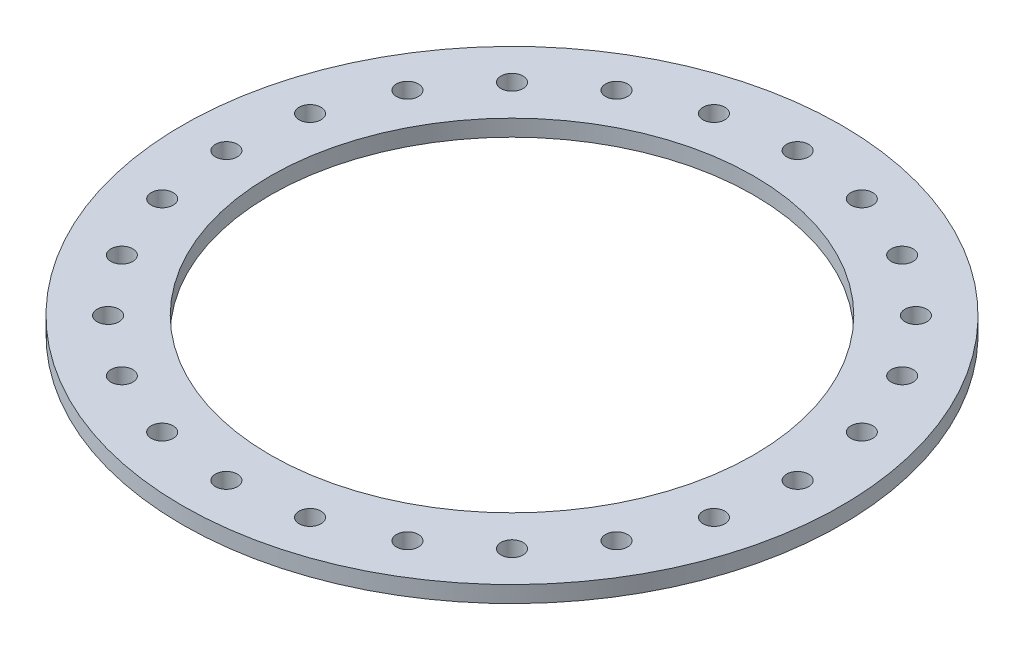
ISO-10303-21;
HEADER;
FILE_DESCRIPTION(('STEP AP214'),'2;1');
FILE_NAME('part.step','',(''),(''),'','','');
FILE_SCHEMA(('AUTOMOTIVE_DESIGN { 1 0 10303 214 1 1 1 1 }'));
ENDSEC;
DATA;
#1=APPLICATION_CONTEXT('core data for automotive mechanical design processes');
#2=APPLICATION_PROTOCOL_DEFINITION('international standard','automotive_design',2000,#1);
#3=PRODUCT_CONTEXT('',#1,'mechanical');
#4=PRODUCT('Part','Part','',(#3));
#5=PRODUCT_RELATED_PRODUCT_CATEGORY('part','',(#4));
#6=PRODUCT_DEFINITION_FORMATION('','',#4);
#7=PRODUCT_DEFINITION_CONTEXT('part definition',#1,'design');
#8=PRODUCT_DEFINITION('design','',#6,#7);
#9=PRODUCT_DEFINITION_SHAPE('','',#8);
#10=(LENGTH_UNIT() NAMED_UNIT(*) SI_UNIT(.MILLI.,.METRE.));
#11=(NAMED_UNIT(*) PLANE_ANGLE_UNIT() SI_UNIT($,.RADIAN.));
#12=(NAMED_UNIT(*) SI_UNIT($,.STERADIAN.) SOLID_ANGLE_UNIT());
#13=UNCERTAINTY_MEASURE_WITH_UNIT(LENGTH_MEASURE(1.E-05),#10,'distance_accuracy_value','');
#14=(GEOMETRIC_REPRESENTATION_CONTEXT(3) GLOBAL_UNCERTAINTY_ASSIGNED_CONTEXT((#13)) GLOBAL_UNIT_ASSIGNED_CONTEXT((#10,
#11,#12)) REPRESENTATION_CONTEXT('',''));
#15=CARTESIAN_POINT('',(0.,0.,0.));
#16=DIRECTION('',(0.,0.,1.));
#17=DIRECTION('',(1.,0.,0.));
#18=AXIS2_PLACEMENT_3D('',#15,#16,#17);
#19=CARTESIAN_POINT('',(0.,19.05,0.));
#20=DIRECTION('',(0.,1.,0.));
#21=DIRECTION('',(0.,0.,1.));
#22=AXIS2_PLACEMENT_3D('',#19,#20,#21);
#23=PLANE('',#22);
#24=CARTESIAN_POINT('',(85.4620486928481,19.05,-318.948707840651));
#25=DIRECTION('',(0.,1.,0.));
#26=DIRECTION('',(0.,0.,1.));
#27=AXIS2_PLACEMENT_3D('',#24,#25,#26);
#28=CIRCLE('',#27,12.7);
#29=CARTESIAN_POINT('',(85.4620486928481,19.05,-306.248707840651));
#30=VERTEX_POINT('',#29);
#31=EDGE_CURVE('E109',#30,#30,#28,.T.);
#32=ORIENTED_EDGE('',*,*,#31,.F.);
#33=EDGE_LOOP('',(#32));
#34=FACE_BOUND('',#33,.T.);
#35=CARTESIAN_POINT('',(165.099999999996,19.05,-285.961588329624));
#36=DIRECTION('',(0.,1.,0.));
#37=DIRECTION('',(0.,0.,1.));
#38=AXIS2_PLACEMENT_3D('',#35,#36,#37);
#39=CIRCLE('',#38,12.7);
#40=CARTESIAN_POINT('',(165.099999999996,19.05,-273.261588329624));
#41=VERTEX_POINT('',#40);
#42=EDGE_CURVE('E99',#41,#41,#39,.T.);
#43=ORIENTED_EDGE('',*,*,#42,.F.);
#44=EDGE_LOOP('',(#43));
#45=FACE_BOUND('',#44,.T.);
#46=CARTESIAN_POINT('',(233.486659147795,19.05,-233.486659147801));
#47=DIRECTION('',(0.,1.,0.));
#48=DIRECTION('',(0.,0.,1.));
#49=AXIS2_PLACEMENT_3D('',#46,#47,#48);
#50=CIRCLE('',#49,12.7);
#51=CARTESIAN_POINT('',(233.486659147795,19.05,-220.786659147801));
#52=VERTEX_POINT('',#51);
#53=EDGE_CURVE('E96',#52,#52,#50,.T.);
#54=ORIENTED_EDGE('',*,*,#53,.F.);
#55=EDGE_LOOP('',(#54));
#56=FACE_BOUND('',#55,.T.);
#57=CARTESIAN_POINT('',(285.96158832962,19.05,-165.100000000003));
#58=DIRECTION('',(0.,1.,0.));
#59=DIRECTION('',(0.,0.,1.));
#60=AXIS2_PLACEMENT_3D('',#57,#58,#59);
#61=CIRCLE('',#60,12.7);
#62=CARTESIAN_POINT('',(285.96158832962,19.05,-152.400000000003));
#63=VERTEX_POINT('',#62);
#64=EDGE_CURVE('E95',#63,#63,#61,.T.);
#65=ORIENTED_EDGE('',*,*,#64,.F.);
#66=EDGE_LOOP('',(#65));
#67=FACE_BOUND('',#66,.T.);
#68=CARTESIAN_POINT('',(318.948707840649,19.05,-85.4620486928559));
#69=DIRECTION('',(0.,1.,0.));
#70=DIRECTION('',(0.,0.,1.));
#71=AXIS2_PLACEMENT_3D('',#68,#69,#70);
#72=CIRCLE('',#71,12.7);
#73=CARTESIAN_POINT('',(318.948707840649,19.05,-72.7620486928559));
#74=VERTEX_POINT('',#73);
#75=EDGE_CURVE('E92',#74,#74,#72,.T.);
#76=ORIENTED_EDGE('',*,*,#75,.F.);
#77=EDGE_LOOP('',(#76));
#78=FACE_BOUND('',#77,.T.);
#79=CARTESIAN_POINT('',(330.2,19.05,-3.45866141425801E-12));
#80=DIRECTION('',(0.,1.,0.));
#81=DIRECTION('',(0.,0.,1.));
#82=AXIS2_PLACEMENT_3D('',#79,#80,#81);
#83=CIRCLE('',#82,12.7);
#84=CARTESIAN_POINT('',(330.2,19.05,12.6999999999965));
#85=VERTEX_POINT('',#84);
#86=EDGE_CURVE('E88',#85,#85,#83,.T.);
#87=ORIENTED_EDGE('',*,*,#86,.F.);
#88=EDGE_LOOP('',(#87));
#89=FACE_BOUND('',#88,.T.);
#90=CARTESIAN_POINT('',(318.948707840651,19.05,85.4620486928492));
#91=DIRECTION('',(0.,1.,0.));
#92=DIRECTION('',(0.,0.,1.));
#93=AXIS2_PLACEMENT_3D('',#90,#91,#92);
#94=CIRCLE('',#93,12.7);
#95=CARTESIAN_POINT('',(318.948707840651,19.05,98.1620486928492));
#96=VERTEX_POINT('',#95);
#97=EDGE_CURVE('E87',#96,#96,#94,.T.);
#98=ORIENTED_EDGE('',*,*,#97,.F.);
#99=EDGE_LOOP('',(#98));
#100=FACE_BOUND('',#99,.T.);
#101=CARTESIAN_POINT('',(285.961588329623,19.05,165.099999999997));
#102=DIRECTION('',(0.,1.,0.));
#103=DIRECTION('',(0.,0.,1.));
#104=AXIS2_PLACEMENT_3D('',#101,#102,#103);
#105=CIRCLE('',#104,12.7);
#106=CARTESIAN_POINT('',(285.961588329623,19.05,177.799999999997));
#107=VERTEX_POINT('',#106);
#108=EDGE_CURVE('E126',#107,#107,#105,.T.);
#109=ORIENTED_EDGE('',*,*,#108,.F.);
#110=EDGE_LOOP('',(#109));
#111=FACE_BOUND('',#110,.T.);
#112=CARTESIAN_POINT('',(233.4866591478,19.05,233.486659147796));
#113=DIRECTION('',(0.,1.,0.));
#114=DIRECTION('',(0.,0.,1.));
#115=AXIS2_PLACEMENT_3D('',#112,#113,#114);
#116=CIRCLE('',#115,12.7);
#117=CARTESIAN_POINT('',(233.4866591478,19.05,246.186659147796));
#118=VERTEX_POINT('',#117);
#119=EDGE_CURVE('E83',#118,#118,#116,.T.);
#120=ORIENTED_EDGE('',*,*,#119,.F.);
#121=EDGE_LOOP('',(#120));
#122=FACE_BOUND('',#121,.T.);
#123=CARTESIAN_POINT('',(165.100000000002,19.05,285.96158832962));
#124=DIRECTION('',(0.,1.,0.));
#125=DIRECTION('',(0.,0.,1.));
#126=AXIS2_PLACEMENT_3D('',#123,#124,#125);
#127=CIRCLE('',#126,12.7);
#128=CARTESIAN_POINT('',(165.100000000002,19.05,298.66158832962));
#129=VERTEX_POINT('',#128);
#130=EDGE_CURVE('E82',#129,#129,#127,.T.);
#131=ORIENTED_EDGE('',*,*,#130,.F.);
#132=EDGE_LOOP('',(#131));
#133=FACE_BOUND('',#132,.T.);
#134=CARTESIAN_POINT('',(85.4620486928548,19.05,318.94870784065));
#135=DIRECTION('',(0.,1.,0.));
#136=DIRECTION('',(0.,0.,1.));
#137=AXIS2_PLACEMENT_3D('',#134,#135,#136);
#138=CIRCLE('',#137,12.7);
#139=CARTESIAN_POINT('',(85.4620486928548,19.05,331.64870784065));
#140=VERTEX_POINT('',#139);
#141=EDGE_CURVE('E78',#140,#140,#138,.T.);
#142=ORIENTED_EDGE('',*,*,#141,.F.);
#143=EDGE_LOOP('',(#142));
#144=FACE_BOUND('',#143,.T.);
#145=CARTESIAN_POINT('',(0.,19.05,330.2));
#146=DIRECTION('',(0.,1.,0.));
#147=DIRECTION('',(0.,0.,1.));
#148=AXIS2_PLACEMENT_3D('',#145,#146,#147);
#149=CIRCLE('',#148,12.7);
#150=CARTESIAN_POINT('',(0.,19.05,342.9));
#151=VERTEX_POINT('',#150);
#152=EDGE_CURVE('E77',#151,#151,#149,.T.);
#153=ORIENTED_EDGE('',*,*,#152,.F.);
#154=EDGE_LOOP('',(#153));
#155=FACE_BOUND('',#154,.T.);
#156=CARTESIAN_POINT('',(-85.4620486928503,19.05,318.948707840651));
#157=DIRECTION('',(0.,1.,0.));
#158=DIRECTION('',(0.,0.,1.));
#159=AXIS2_PLACEMENT_3D('',#156,#157,#158);
#160=CIRCLE('',#159,12.7);
#161=CARTESIAN_POINT('',(-85.4620486928503,19.05,331.648707840651));
#162=VERTEX_POINT('',#161);
#163=EDGE_CURVE('E146',#162,#162,#160,.T.);
#164=ORIENTED_EDGE('',*,*,#163,.F.);
#165=EDGE_LOOP('',(#164));
#166=FACE_BOUND('',#165,.T.);
#167=CARTESIAN_POINT('',(-165.099999999998,19.05,285.961588329623));
#168=DIRECTION('',(0.,1.,0.));
#169=DIRECTION('',(0.,0.,1.));
#170=AXIS2_PLACEMENT_3D('',#167,#168,#169);
#171=CIRCLE('',#170,12.7);
#172=CARTESIAN_POINT('',(-165.099999999998,19.05,298.661588329623));
#173=VERTEX_POINT('',#172);
#174=EDGE_CURVE('E152',#173,#173,#171,.T.);
#175=ORIENTED_EDGE('',*,*,#174,.F.);
#176=EDGE_LOOP('',(#175));
#177=FACE_BOUND('',#176,.T.);
#178=CARTESIAN_POINT('',(-233.486659147797,19.05,233.486659147799));
#179=DIRECTION('',(0.,1.,0.));
#180=DIRECTION('',(0.,0.,1.));
#181=AXIS2_PLACEMENT_3D('',#178,#179,#180);
#182=CIRCLE('',#181,12.7);
#183=CARTESIAN_POINT('',(-233.486659147797,19.05,246.186659147799));
#184=VERTEX_POINT('',#183);
#185=EDGE_CURVE('E158',#184,#184,#182,.T.);
#186=ORIENTED_EDGE('',*,*,#185,.F.);
#187=EDGE_LOOP('',(#186));
#188=FACE_BOUND('',#187,.T.);
#189=CARTESIAN_POINT('',(-285.961588329621,19.05,165.100000000001));
#190=DIRECTION('',(0.,1.,0.));
#191=DIRECTION('',(0.,0.,1.));
#192=AXIS2_PLACEMENT_3D('',#189,#190,#191);
#193=CIRCLE('',#192,12.7);
#194=CARTESIAN_POINT('',(-285.961588329621,19.05,177.800000000001));
#195=VERTEX_POINT('',#194);
#196=EDGE_CURVE('E73',#195,#195,#193,.T.);
#197=ORIENTED_EDGE('',*,*,#196,.F.);
#198=EDGE_LOOP('',(#197));
#199=FACE_BOUND('',#198,.T.);
#200=CARTESIAN_POINT('',(-318.94870784065,19.05,85.4620486928537));
#201=DIRECTION('',(0.,1.,0.));
#202=DIRECTION('',(0.,0.,1.));
#203=AXIS2_PLACEMENT_3D('',#200,#201,#202);
#204=CIRCLE('',#203,12.7);
#205=CARTESIAN_POINT('',(-318.94870784065,19.05,98.1620486928536));
#206=VERTEX_POINT('',#205);
#207=EDGE_CURVE('E69',#206,#206,#204,.T.);
#208=ORIENTED_EDGE('',*,*,#207,.F.);
#209=EDGE_LOOP('',(#208));
#210=FACE_BOUND('',#209,.T.);
#211=CARTESIAN_POINT('',(-330.2,19.05,1.152887138086E-12));
#212=DIRECTION('',(0.,1.,0.));
#213=DIRECTION('',(0.,0.,1.));
#214=AXIS2_PLACEMENT_3D('',#211,#212,#213);
#215=CIRCLE('',#214,12.7);
#216=CARTESIAN_POINT('',(-330.2,19.05,12.7000000000011));
#217=VERTEX_POINT('',#216);
#218=EDGE_CURVE('E68',#217,#217,#215,.T.);
#219=ORIENTED_EDGE('',*,*,#218,.F.);
#220=EDGE_LOOP('',(#219));
#221=FACE_BOUND('',#220,.T.);
#222=CARTESIAN_POINT('',(-318.948707840651,19.05,-85.4620486928514));
#223=DIRECTION('',(0.,1.,0.));
#224=DIRECTION('',(0.,0.,1.));
#225=AXIS2_PLACEMENT_3D('',#222,#223,#224);
#226=CIRCLE('',#225,12.7);
#227=CARTESIAN_POINT('',(-318.948707840651,19.05,-72.7620486928514));
#228=VERTEX_POINT('',#227);
#229=EDGE_CURVE('E173',#228,#228,#226,.T.);
#230=ORIENTED_EDGE('',*,*,#229,.F.);
#231=EDGE_LOOP('',(#230));
#232=FACE_BOUND('',#231,.T.);
#233=CARTESIAN_POINT('',(-285.961588329622,19.05,-165.099999999999));
#234=DIRECTION('',(0.,1.,0.));
#235=DIRECTION('',(0.,0.,1.));
#236=AXIS2_PLACEMENT_3D('',#233,#234,#235);
#237=CIRCLE('',#236,12.7);
#238=CARTESIAN_POINT('',(-285.961588329622,19.05,-152.399999999999));
#239=VERTEX_POINT('',#238);
#240=EDGE_CURVE('E179',#239,#239,#237,.T.);
#241=ORIENTED_EDGE('',*,*,#240,.F.);
#242=EDGE_LOOP('',(#241));
#243=FACE_BOUND('',#242,.T.);
#244=CARTESIAN_POINT('',(-233.486659147798,19.05,-233.486659147798));
#245=DIRECTION('',(0.,1.,0.));
#246=DIRECTION('',(0.,0.,1.));
#247=AXIS2_PLACEMENT_3D('',#244,#245,#246);
#248=CIRCLE('',#247,12.7);
#249=CARTESIAN_POINT('',(-233.486659147798,19.05,-220.786659147798));
#250=VERTEX_POINT('',#249);
#251=EDGE_CURVE('E64',#250,#250,#248,.T.);
#252=ORIENTED_EDGE('',*,*,#251,.F.);
#253=EDGE_LOOP('',(#252));
#254=FACE_BOUND('',#253,.T.);
#255=CARTESIAN_POINT('',(-165.1,19.05,-285.961588329621));
#256=DIRECTION('',(0.,1.,0.));
#257=DIRECTION('',(0.,0.,1.));
#258=AXIS2_PLACEMENT_3D('',#255,#256,#257);
#259=CIRCLE('',#258,12.7);
#260=CARTESIAN_POINT('',(-165.1,19.05,-273.261588329621));
#261=VERTEX_POINT('',#260);
#262=EDGE_CURVE('E60',#261,#261,#259,.T.);
#263=ORIENTED_EDGE('',*,*,#262,.F.);
#264=EDGE_LOOP('',(#263));
#265=FACE_BOUND('',#264,.T.);
#266=CARTESIAN_POINT('',(-85.4620486928525,19.05,-318.94870784065));
#267=DIRECTION('',(0.,1.,0.));
#268=DIRECTION('',(0.,0.,1.));
#269=AXIS2_PLACEMENT_3D('',#266,#267,#268);
#270=CIRCLE('',#269,12.7);
#271=CARTESIAN_POINT('',(-85.4620486928525,19.05,-306.24870784065));
#272=VERTEX_POINT('',#271);
#273=EDGE_CURVE('E56',#272,#272,#270,.T.);
#274=ORIENTED_EDGE('',*,*,#273,.F.);
#275=EDGE_LOOP('',(#274));
#276=FACE_BOUND('',#275,.T.);
#277=CARTESIAN_POINT('',(0.,19.05,-330.2));
#278=DIRECTION('',(0.,1.,0.));
#279=DIRECTION('',(0.,0.,1.));
#280=AXIS2_PLACEMENT_3D('',#277,#278,#279);
#281=CIRCLE('',#280,12.7);
#282=CARTESIAN_POINT('',(0.,19.05,-317.5));
#283=VERTEX_POINT('',#282);
#284=EDGE_CURVE('E55',#283,#283,#281,.T.);
#285=ORIENTED_EDGE('',*,*,#284,.F.);
#286=EDGE_LOOP('',(#285));
#287=FACE_BOUND('',#286,.T.);
#288=CARTESIAN_POINT('',(0.,19.05,0.));
#289=DIRECTION('',(0.,1.,0.));
#290=DIRECTION('',(0.,0.,1.));
#291=AXIS2_PLACEMENT_3D('',#288,#289,#290);
#292=CIRCLE('',#291,381.);
#293=CARTESIAN_POINT('',(0.,19.05,381.));
#294=VERTEX_POINT('',#293);
#295=EDGE_CURVE('E10',#294,#294,#292,.T.);
#296=ORIENTED_EDGE('',*,*,#295,.T.);
#297=EDGE_LOOP('',(#296));
#298=FACE_BOUND('',#297,.T.);
#299=CARTESIAN_POINT('',(0.,19.05,0.));
#300=DIRECTION('',(0.,1.,0.));
#301=DIRECTION('',(0.,0.,1.));
#302=AXIS2_PLACEMENT_3D('',#299,#300,#301);
#303=CIRCLE('',#302,279.4);
#304=CARTESIAN_POINT('',(0.,19.05,279.4));
#305=VERTEX_POINT('',#304);
#306=EDGE_CURVE('E46',#305,#305,#303,.T.);
#307=ORIENTED_EDGE('',*,*,#306,.F.);
#308=EDGE_LOOP('',(#307));
#309=FACE_BOUND('',#308,.T.);
#310=ADVANCED_FACE('F33',(#34,#45,#56,#67,#78,#89,#100,#111,#122,#133,#144,#155,#166,#177,#188,
#199,#210,#221,#232,#243,#254,#265,#276,#287,#298,#309),#23,.T.);
#311=CARTESIAN_POINT('',(0.,0.,0.));
#312=DIRECTION('',(0.,1.,0.));
#313=DIRECTION('',(0.,0.,1.));
#314=AXIS2_PLACEMENT_3D('',#311,#312,#313);
#315=PLANE('',#314);
#316=CARTESIAN_POINT('',(85.4620486928481,0.,-318.948707840651));
#317=DIRECTION('',(0.,1.,0.));
#318=DIRECTION('',(0.,0.,1.));
#319=AXIS2_PLACEMENT_3D('',#316,#317,#318);
#320=CIRCLE('',#319,12.7);
#321=CARTESIAN_POINT('',(85.4620486928481,0.,-306.248707840651));
#322=VERTEX_POINT('',#321);
#323=EDGE_CURVE('E37',#322,#322,#320,.T.);
#324=ORIENTED_EDGE('',*,*,#323,.T.);
#325=EDGE_LOOP('',(#324));
#326=FACE_BOUND('',#325,.T.);
#327=CARTESIAN_POINT('',(165.099999999996,0.,-285.961588329624));
#328=DIRECTION('',(0.,1.,0.));
#329=DIRECTION('',(0.,0.,1.));
#330=AXIS2_PLACEMENT_3D('',#327,#328,#329);
#331=CIRCLE('',#330,12.7);
#332=CARTESIAN_POINT('',(165.099999999996,0.,-273.261588329624));
#333=VERTEX_POINT('',#332);
#334=EDGE_CURVE('E97',#333,#333,#331,.T.);
#335=ORIENTED_EDGE('',*,*,#334,.T.);
#336=EDGE_LOOP('',(#335));
#337=FACE_BOUND('',#336,.T.);
#338=CARTESIAN_POINT('',(233.486659147795,0.,-233.486659147801));
#339=DIRECTION('',(0.,1.,0.));
#340=DIRECTION('',(0.,0.,1.));
#341=AXIS2_PLACEMENT_3D('',#338,#339,#340);
#342=CIRCLE('',#341,12.7);
#343=CARTESIAN_POINT('',(233.486659147795,0.,-220.786659147801));
#344=VERTEX_POINT('',#343);
#345=EDGE_CURVE('E93',#344,#344,#342,.T.);
#346=ORIENTED_EDGE('',*,*,#345,.T.);
#347=EDGE_LOOP('',(#346));
#348=FACE_BOUND('',#347,.T.);
#349=CARTESIAN_POINT('',(285.96158832962,0.,-165.100000000003));
#350=DIRECTION('',(0.,1.,0.));
#351=DIRECTION('',(0.,0.,1.));
#352=AXIS2_PLACEMENT_3D('',#349,#350,#351);
#353=CIRCLE('',#352,12.7);
#354=CARTESIAN_POINT('',(285.96158832962,0.,-152.400000000003));
#355=VERTEX_POINT('',#354);
#356=EDGE_CURVE('E114',#355,#355,#353,.T.);
#357=ORIENTED_EDGE('',*,*,#356,.T.);
#358=EDGE_LOOP('',(#357));
#359=FACE_BOUND('',#358,.T.);
#360=CARTESIAN_POINT('',(318.948707840649,0.,-85.4620486928559));
#361=DIRECTION('',(0.,1.,0.));
#362=DIRECTION('',(0.,0.,1.));
#363=AXIS2_PLACEMENT_3D('',#360,#361,#362);
#364=CIRCLE('',#363,12.7);
#365=CARTESIAN_POINT('',(318.948707840649,0.,-72.7620486928559));
#366=VERTEX_POINT('',#365);
#367=EDGE_CURVE('E89',#366,#366,#364,.T.);
#368=ORIENTED_EDGE('',*,*,#367,.T.);
#369=EDGE_LOOP('',(#368));
#370=FACE_BOUND('',#369,.T.);
#371=CARTESIAN_POINT('',(330.2,0.,-3.45866141425801E-12));
#372=DIRECTION('',(0.,1.,0.));
#373=DIRECTION('',(0.,0.,1.));
#374=AXIS2_PLACEMENT_3D('',#371,#372,#373);
#375=CIRCLE('',#374,12.7);
#376=CARTESIAN_POINT('',(330.2,0.,12.6999999999965));
#377=VERTEX_POINT('',#376);
#378=EDGE_CURVE('E84',#377,#377,#375,.T.);
#379=ORIENTED_EDGE('',*,*,#378,.T.);
#380=EDGE_LOOP('',(#379));
#381=FACE_BOUND('',#380,.T.);
#382=CARTESIAN_POINT('',(318.948707840651,0.,85.4620486928492));
#383=DIRECTION('',(0.,1.,0.));
#384=DIRECTION('',(0.,0.,1.));
#385=AXIS2_PLACEMENT_3D('',#382,#383,#384);
#386=CIRCLE('',#385,12.7);
#387=CARTESIAN_POINT('',(318.948707840651,0.,98.1620486928492));
#388=VERTEX_POINT('',#387);
#389=EDGE_CURVE('E123',#388,#388,#386,.T.);
#390=ORIENTED_EDGE('',*,*,#389,.T.);
#391=EDGE_LOOP('',(#390));
#392=FACE_BOUND('',#391,.T.);
#393=CARTESIAN_POINT('',(285.961588329623,0.,165.099999999997));
#394=DIRECTION('',(0.,1.,0.));
#395=DIRECTION('',(0.,0.,1.));
#396=AXIS2_PLACEMENT_3D('',#393,#394,#395);
#397=CIRCLE('',#396,12.7);
#398=CARTESIAN_POINT('',(285.961588329623,0.,177.799999999997));
#399=VERTEX_POINT('',#398);
#400=EDGE_CURVE('E129',#399,#399,#397,.T.);
#401=ORIENTED_EDGE('',*,*,#400,.T.);
#402=EDGE_LOOP('',(#401));
#403=FACE_BOUND('',#402,.T.);
#404=CARTESIAN_POINT('',(233.4866591478,0.,233.486659147796));
#405=DIRECTION('',(0.,1.,0.));
#406=DIRECTION('',(0.,0.,1.));
#407=AXIS2_PLACEMENT_3D('',#404,#405,#406);
#408=CIRCLE('',#407,12.7);
#409=CARTESIAN_POINT('',(233.4866591478,0.,246.186659147796));
#410=VERTEX_POINT('',#409);
#411=EDGE_CURVE('E79',#410,#410,#408,.T.);
#412=ORIENTED_EDGE('',*,*,#411,.T.);
#413=EDGE_LOOP('',(#412));
#414=FACE_BOUND('',#413,.T.);
#415=CARTESIAN_POINT('',(165.100000000002,0.,285.96158832962));
#416=DIRECTION('',(0.,1.,0.));
#417=DIRECTION('',(0.,0.,1.));
#418=AXIS2_PLACEMENT_3D('',#415,#416,#417);
#419=CIRCLE('',#418,12.7);
#420=CARTESIAN_POINT('',(165.100000000002,0.,298.66158832962));
#421=VERTEX_POINT('',#420);
#422=EDGE_CURVE('E136',#421,#421,#419,.T.);
#423=ORIENTED_EDGE('',*,*,#422,.T.);
#424=EDGE_LOOP('',(#423));
#425=FACE_BOUND('',#424,.T.);
#426=CARTESIAN_POINT('',(85.4620486928548,0.,318.94870784065));
#427=DIRECTION('',(0.,1.,0.));
#428=DIRECTION('',(0.,0.,1.));
#429=AXIS2_PLACEMENT_3D('',#426,#427,#428);
#430=CIRCLE('',#429,12.7);
#431=CARTESIAN_POINT('',(85.4620486928548,0.,331.64870784065));
#432=VERTEX_POINT('',#431);
#433=EDGE_CURVE('E74',#432,#432,#430,.T.);
#434=ORIENTED_EDGE('',*,*,#433,.T.);
#435=EDGE_LOOP('',(#434));
#436=FACE_BOUND('',#435,.T.);
#437=CARTESIAN_POINT('',(0.,0.,330.2));
#438=DIRECTION('',(0.,1.,0.));
#439=DIRECTION('',(0.,0.,1.));
#440=AXIS2_PLACEMENT_3D('',#437,#438,#439);
#441=CIRCLE('',#440,12.7);
#442=CARTESIAN_POINT('',(0.,0.,342.9));
#443=VERTEX_POINT('',#442);
#444=EDGE_CURVE('E143',#443,#443,#441,.T.);
#445=ORIENTED_EDGE('',*,*,#444,.T.);
#446=EDGE_LOOP('',(#445));
#447=FACE_BOUND('',#446,.T.);
#448=CARTESIAN_POINT('',(-85.4620486928503,0.,318.948707840651));
#449=DIRECTION('',(0.,1.,0.));
#450=DIRECTION('',(0.,0.,1.));
#451=AXIS2_PLACEMENT_3D('',#448,#449,#450);
#452=CIRCLE('',#451,12.7);
#453=CARTESIAN_POINT('',(-85.4620486928503,0.,331.648707840651));
#454=VERTEX_POINT('',#453);
#455=EDGE_CURVE('E149',#454,#454,#452,.T.);
#456=ORIENTED_EDGE('',*,*,#455,.T.);
#457=EDGE_LOOP('',(#456));
#458=FACE_BOUND('',#457,.T.);
#459=CARTESIAN_POINT('',(-165.099999999998,0.,285.961588329623));
#460=DIRECTION('',(0.,1.,0.));
#461=DIRECTION('',(0.,0.,1.));
#462=AXIS2_PLACEMENT_3D('',#459,#460,#461);
#463=CIRCLE('',#462,12.7);
#464=CARTESIAN_POINT('',(-165.099999999998,0.,298.661588329623));
#465=VERTEX_POINT('',#464);
#466=EDGE_CURVE('E155',#465,#465,#463,.T.);
#467=ORIENTED_EDGE('',*,*,#466,.T.);
#468=EDGE_LOOP('',(#467));
#469=FACE_BOUND('',#468,.T.);
#470=CARTESIAN_POINT('',(-233.486659147797,0.,233.486659147799));
#471=DIRECTION('',(0.,1.,0.));
#472=DIRECTION('',(0.,0.,1.));
#473=AXIS2_PLACEMENT_3D('',#470,#471,#472);
#474=CIRCLE('',#473,12.7);
#475=CARTESIAN_POINT('',(-233.486659147797,0.,246.186659147799));
#476=VERTEX_POINT('',#475);
#477=EDGE_CURVE('E161',#476,#476,#474,.T.);
#478=ORIENTED_EDGE('',*,*,#477,.T.);
#479=EDGE_LOOP('',(#478));
#480=FACE_BOUND('',#479,.T.);
#481=CARTESIAN_POINT('',(-285.961588329621,0.,165.100000000001));
#482=DIRECTION('',(0.,1.,0.));
#483=DIRECTION('',(0.,0.,1.));
#484=AXIS2_PLACEMENT_3D('',#481,#482,#483);
#485=CIRCLE('',#484,12.7);
#486=CARTESIAN_POINT('',(-285.961588329621,0.,177.800000000001));
#487=VERTEX_POINT('',#486);
#488=EDGE_CURVE('E70',#487,#487,#485,.T.);
#489=ORIENTED_EDGE('',*,*,#488,.T.);
#490=EDGE_LOOP('',(#489));
#491=FACE_BOUND('',#490,.T.);
#492=CARTESIAN_POINT('',(-318.94870784065,0.,85.4620486928537));
#493=DIRECTION('',(0.,1.,0.));
#494=DIRECTION('',(0.,0.,1.));
#495=AXIS2_PLACEMENT_3D('',#492,#493,#494);
#496=CIRCLE('',#495,12.7);
#497=CARTESIAN_POINT('',(-318.94870784065,0.,98.1620486928536));
#498=VERTEX_POINT('',#497);
#499=EDGE_CURVE('E65',#498,#498,#496,.T.);
#500=ORIENTED_EDGE('',*,*,#499,.T.);
#501=EDGE_LOOP('',(#500));
#502=FACE_BOUND('',#501,.T.);
#503=CARTESIAN_POINT('',(-330.2,0.,1.152887138086E-12));
#504=DIRECTION('',(0.,1.,0.));
#505=DIRECTION('',(0.,0.,1.));
#506=AXIS2_PLACEMENT_3D('',#503,#504,#505);
#507=CIRCLE('',#506,12.7);
#508=CARTESIAN_POINT('',(-330.2,0.,12.7000000000011));
#509=VERTEX_POINT('',#508);
#510=EDGE_CURVE('E170',#509,#509,#507,.T.);
#511=ORIENTED_EDGE('',*,*,#510,.T.);
#512=EDGE_LOOP('',(#511));
#513=FACE_BOUND('',#512,.T.);
#514=CARTESIAN_POINT('',(-318.948707840651,0.,-85.4620486928514));
#515=DIRECTION('',(0.,1.,0.));
#516=DIRECTION('',(0.,0.,1.));
#517=AXIS2_PLACEMENT_3D('',#514,#515,#516);
#518=CIRCLE('',#517,12.7);
#519=CARTESIAN_POINT('',(-318.948707840651,0.,-72.7620486928514));
#520=VERTEX_POINT('',#519);
#521=EDGE_CURVE('E176',#520,#520,#518,.T.);
#522=ORIENTED_EDGE('',*,*,#521,.T.);
#523=EDGE_LOOP('',(#522));
#524=FACE_BOUND('',#523,.T.);
#525=CARTESIAN_POINT('',(-285.961588329622,0.,-165.099999999999));
#526=DIRECTION('',(0.,1.,0.));
#527=DIRECTION('',(0.,0.,1.));
#528=AXIS2_PLACEMENT_3D('',#525,#526,#527);
#529=CIRCLE('',#528,12.7);
#530=CARTESIAN_POINT('',(-285.961588329622,0.,-152.399999999999));
#531=VERTEX_POINT('',#530);
#532=EDGE_CURVE('E182',#531,#531,#529,.T.);
#533=ORIENTED_EDGE('',*,*,#532,.T.);
#534=EDGE_LOOP('',(#533));
#535=FACE_BOUND('',#534,.T.);
#536=CARTESIAN_POINT('',(-233.486659147798,0.,-233.486659147798));
#537=DIRECTION('',(0.,1.,0.));
#538=DIRECTION('',(0.,0.,1.));
#539=AXIS2_PLACEMENT_3D('',#536,#537,#538);
#540=CIRCLE('',#539,12.7);
#541=CARTESIAN_POINT('',(-233.486659147798,0.,-220.786659147798));
#542=VERTEX_POINT('',#541);
#543=EDGE_CURVE('E61',#542,#542,#540,.T.);
#544=ORIENTED_EDGE('',*,*,#543,.T.);
#545=EDGE_LOOP('',(#544));
#546=FACE_BOUND('',#545,.T.);
#547=CARTESIAN_POINT('',(-165.1,0.,-285.961588329621));
#548=DIRECTION('',(0.,1.,0.));
#549=DIRECTION('',(0.,0.,1.));
#550=AXIS2_PLACEMENT_3D('',#547,#548,#549);
#551=CIRCLE('',#550,12.7);
#552=CARTESIAN_POINT('',(-165.1,0.,-273.261588329621));
#553=VERTEX_POINT('',#552);
#554=EDGE_CURVE('E57',#553,#553,#551,.T.);
#555=ORIENTED_EDGE('',*,*,#554,.T.);
#556=EDGE_LOOP('',(#555));
#557=FACE_BOUND('',#556,.T.);
#558=CARTESIAN_POINT('',(-85.4620486928525,0.,-318.94870784065));
#559=DIRECTION('',(0.,1.,0.));
#560=DIRECTION('',(0.,0.,1.));
#561=AXIS2_PLACEMENT_3D('',#558,#559,#560);
#562=CIRCLE('',#561,12.7);
#563=CARTESIAN_POINT('',(-85.4620486928525,0.,-306.24870784065));
#564=VERTEX_POINT('',#563);
#565=EDGE_CURVE('E52',#564,#564,#562,.T.);
#566=ORIENTED_EDGE('',*,*,#565,.T.);
#567=EDGE_LOOP('',(#566));
#568=FACE_BOUND('',#567,.T.);
#569=CARTESIAN_POINT('',(0.,0.,-330.2));
#570=DIRECTION('',(0.,1.,0.));
#571=DIRECTION('',(0.,0.,1.));
#572=AXIS2_PLACEMENT_3D('',#569,#570,#571);
#573=CIRCLE('',#572,12.7);
#574=CARTESIAN_POINT('',(0.,0.,-317.5));
#575=VERTEX_POINT('',#574);
#576=EDGE_CURVE('E193',#575,#575,#573,.T.);
#577=ORIENTED_EDGE('',*,*,#576,.T.);
#578=EDGE_LOOP('',(#577));
#579=FACE_BOUND('',#578,.T.);
#580=CARTESIAN_POINT('',(0.,0.,0.));
#581=DIRECTION('',(0.,1.,0.));
#582=DIRECTION('',(0.,0.,1.));
#583=AXIS2_PLACEMENT_3D('',#580,#581,#582);
#584=CIRCLE('',#583,381.);
#585=CARTESIAN_POINT('',(0.,0.,381.));
#586=VERTEX_POINT('',#585);
#587=EDGE_CURVE('E41',#586,#586,#584,.T.);
#588=ORIENTED_EDGE('',*,*,#587,.F.);
#589=EDGE_LOOP('',(#588));
#590=FACE_BOUND('',#589,.T.);
#591=CARTESIAN_POINT('',(0.,0.,0.));
#592=DIRECTION('',(0.,1.,0.));
#593=DIRECTION('',(0.,0.,1.));
#594=AXIS2_PLACEMENT_3D('',#591,#592,#593);
#595=CIRCLE('',#594,279.4);
#596=CARTESIAN_POINT('',(0.,0.,279.4));
#597=VERTEX_POINT('',#596);
#598=EDGE_CURVE('E49',#597,#597,#595,.T.);
#599=ORIENTED_EDGE('',*,*,#598,.T.);
#600=EDGE_LOOP('',(#599));
#601=FACE_BOUND('',#600,.T.);
#602=ADVANCED_FACE('F201',(#326,#337,#348,#359,#370,#381,#392,#403,#414,#425,#436,#447,#458,
#469,#480,#491,#502,#513,#524,#535,#546,#557,#568,#579,#590,#601),#315,.F.);
#603=CARTESIAN_POINT('',(0.,19.05,0.));
#604=DIRECTION('',(0.,-1.,0.));
#605=DIRECTION('',(0.,0.,-1.));
#606=AXIS2_PLACEMENT_3D('',#603,#604,#605);
#607=CYLINDRICAL_SURFACE('',#606,381.);
#608=ORIENTED_EDGE('',*,*,#295,.F.);
#609=EDGE_LOOP('',(#608));
#610=FACE_BOUND('',#609,.T.);
#611=ORIENTED_EDGE('',*,*,#587,.T.);
#612=EDGE_LOOP('',(#611));
#613=FACE_BOUND('',#612,.T.);
#614=ADVANCED_FACE('F35',(#610,#613),#607,.T.);
#615=CARTESIAN_POINT('',(0.,19.05,0.));
#616=DIRECTION('',(0.,-1.,0.));
#617=DIRECTION('',(0.,0.,-1.));
#618=AXIS2_PLACEMENT_3D('',#615,#616,#617);
#619=CYLINDRICAL_SURFACE('',#618,279.4);
#620=ORIENTED_EDGE('',*,*,#306,.T.);
#621=EDGE_LOOP('',(#620));
#622=FACE_BOUND('',#621,.T.);
#623=ORIENTED_EDGE('',*,*,#598,.F.);
#624=EDGE_LOOP('',(#623));
#625=FACE_BOUND('',#624,.T.);
#626=ADVANCED_FACE('F203',(#622,#625),#619,.F.);
#627=CARTESIAN_POINT('',(0.,19.05,-330.2));
#628=DIRECTION('',(0.,1.,0.));
#629=DIRECTION('',(0.,0.,1.));
#630=AXIS2_PLACEMENT_3D('',#627,#628,#629);
#631=CYLINDRICAL_SURFACE('',#630,12.7);
#632=ORIENTED_EDGE('',*,*,#284,.T.);
#633=EDGE_LOOP('',(#632));
#634=FACE_BOUND('',#633,.T.);
#635=ORIENTED_EDGE('',*,*,#576,.F.);
#636=EDGE_LOOP('',(#635));
#637=FACE_BOUND('',#636,.T.);
#638=ADVANCED_FACE('F205',(#634,#637),#631,.F.);
#639=CARTESIAN_POINT('',(-85.4620486928525,19.05,-318.94870784065));
#640=DIRECTION('',(0.,1.,0.));
#641=DIRECTION('',(0.,0.,1.));
#642=AXIS2_PLACEMENT_3D('',#639,#640,#641);
#643=CYLINDRICAL_SURFACE('',#642,12.7);
#644=ORIENTED_EDGE('',*,*,#273,.T.);
#645=EDGE_LOOP('',(#644));
#646=FACE_BOUND('',#645,.T.);
#647=ORIENTED_EDGE('',*,*,#565,.F.);
#648=EDGE_LOOP('',(#647));
#649=FACE_BOUND('',#648,.T.);
#650=ADVANCED_FACE('F211',(#646,#649),#643,.F.);
#651=CARTESIAN_POINT('',(-165.1,19.05,-285.961588329621));
#652=DIRECTION('',(0.,1.,0.));
#653=DIRECTION('',(0.,0.,1.));
#654=AXIS2_PLACEMENT_3D('',#651,#652,#653);
#655=CYLINDRICAL_SURFACE('',#654,12.7);
#656=ORIENTED_EDGE('',*,*,#262,.T.);
#657=EDGE_LOOP('',(#656));
#658=FACE_BOUND('',#657,.T.);
#659=ORIENTED_EDGE('',*,*,#554,.F.);
#660=EDGE_LOOP('',(#659));
#661=FACE_BOUND('',#660,.T.);
#662=ADVANCED_FACE('F279',(#658,#661),#655,.F.);
#663=CARTESIAN_POINT('',(-233.486659147798,19.05,-233.486659147798));
#664=DIRECTION('',(0.,1.,0.));
#665=DIRECTION('',(0.,0.,1.));
#666=AXIS2_PLACEMENT_3D('',#663,#664,#665);
#667=CYLINDRICAL_SURFACE('',#666,12.7);
#668=ORIENTED_EDGE('',*,*,#251,.T.);
#669=EDGE_LOOP('',(#668));
#670=FACE_BOUND('',#669,.T.);
#671=ORIENTED_EDGE('',*,*,#543,.F.);
#672=EDGE_LOOP('',(#671));
#673=FACE_BOUND('',#672,.T.);
#674=ADVANCED_FACE('F286',(#670,#673),#667,.F.);
#675=CARTESIAN_POINT('',(-285.961588329622,19.05,-165.099999999999));
#676=DIRECTION('',(0.,1.,0.));
#677=DIRECTION('',(0.,0.,1.));
#678=AXIS2_PLACEMENT_3D('',#675,#676,#677);
#679=CYLINDRICAL_SURFACE('',#678,12.7);
#680=ORIENTED_EDGE('',*,*,#240,.T.);
#681=EDGE_LOOP('',(#680));
#682=FACE_BOUND('',#681,.T.);
#683=ORIENTED_EDGE('',*,*,#532,.F.);
#684=EDGE_LOOP('',(#683));
#685=FACE_BOUND('',#684,.T.);
#686=ADVANCED_FACE('F292',(#682,#685),#679,.F.);
#687=CARTESIAN_POINT('',(-318.948707840651,19.05,-85.4620486928514));
#688=DIRECTION('',(0.,1.,0.));
#689=DIRECTION('',(0.,0.,1.));
#690=AXIS2_PLACEMENT_3D('',#687,#688,#689);
#691=CYLINDRICAL_SURFACE('',#690,12.7);
#692=ORIENTED_EDGE('',*,*,#229,.T.);
#693=EDGE_LOOP('',(#692));
#694=FACE_BOUND('',#693,.T.);
#695=ORIENTED_EDGE('',*,*,#521,.F.);
#696=EDGE_LOOP('',(#695));
#697=FACE_BOUND('',#696,.T.);
#698=ADVANCED_FACE('F296',(#694,#697),#691,.F.);
#699=CARTESIAN_POINT('',(-330.2,19.05,1.152887138086E-12));
#700=DIRECTION('',(0.,1.,0.));
#701=DIRECTION('',(0.,0.,1.));
#702=AXIS2_PLACEMENT_3D('',#699,#700,#701);
#703=CYLINDRICAL_SURFACE('',#702,12.7);
#704=ORIENTED_EDGE('',*,*,#218,.T.);
#705=EDGE_LOOP('',(#704));
#706=FACE_BOUND('',#705,.T.);
#707=ORIENTED_EDGE('',*,*,#510,.F.);
#708=EDGE_LOOP('',(#707));
#709=FACE_BOUND('',#708,.T.);
#710=ADVANCED_FACE('F300',(#706,#709),#703,.F.);
#711=CARTESIAN_POINT('',(-318.94870784065,19.05,85.4620486928537));
#712=DIRECTION('',(0.,1.,0.));
#713=DIRECTION('',(0.,0.,1.));
#714=AXIS2_PLACEMENT_3D('',#711,#712,#713);
#715=CYLINDRICAL_SURFACE('',#714,12.7);
#716=ORIENTED_EDGE('',*,*,#207,.T.);
#717=EDGE_LOOP('',(#716));
#718=FACE_BOUND('',#717,.T.);
#719=ORIENTED_EDGE('',*,*,#499,.F.);
#720=EDGE_LOOP('',(#719));
#721=FACE_BOUND('',#720,.T.);
#722=ADVANCED_FACE('F304',(#718,#721),#715,.F.);
#723=CARTESIAN_POINT('',(-285.961588329621,19.05,165.100000000001));
#724=DIRECTION('',(0.,1.,0.));
#725=DIRECTION('',(0.,0.,1.));
#726=AXIS2_PLACEMENT_3D('',#723,#724,#725);
#727=CYLINDRICAL_SURFACE('',#726,12.7);
#728=ORIENTED_EDGE('',*,*,#196,.T.);
#729=EDGE_LOOP('',(#728));
#730=FACE_BOUND('',#729,.T.);
#731=ORIENTED_EDGE('',*,*,#488,.F.);
#732=EDGE_LOOP('',(#731));
#733=FACE_BOUND('',#732,.T.);
#734=ADVANCED_FACE('F308',(#730,#733),#727,.F.);
#735=CARTESIAN_POINT('',(-233.486659147797,19.05,233.486659147799));
#736=DIRECTION('',(0.,1.,0.));
#737=DIRECTION('',(0.,0.,1.));
#738=AXIS2_PLACEMENT_3D('',#735,#736,#737);
#739=CYLINDRICAL_SURFACE('',#738,12.7);
#740=ORIENTED_EDGE('',*,*,#185,.T.);
#741=EDGE_LOOP('',(#740));
#742=FACE_BOUND('',#741,.T.);
#743=ORIENTED_EDGE('',*,*,#477,.F.);
#744=EDGE_LOOP('',(#743));
#745=FACE_BOUND('',#744,.T.);
#746=ADVANCED_FACE('F312',(#742,#745),#739,.F.);
#747=CARTESIAN_POINT('',(-165.099999999998,19.05,285.961588329623));
#748=DIRECTION('',(0.,1.,0.));
#749=DIRECTION('',(0.,0.,1.));
#750=AXIS2_PLACEMENT_3D('',#747,#748,#749);
#751=CYLINDRICAL_SURFACE('',#750,12.7);
#752=ORIENTED_EDGE('',*,*,#174,.T.);
#753=EDGE_LOOP('',(#752));
#754=FACE_BOUND('',#753,.T.);
#755=ORIENTED_EDGE('',*,*,#466,.F.);
#756=EDGE_LOOP('',(#755));
#757=FACE_BOUND('',#756,.T.);
#758=ADVANCED_FACE('F316',(#754,#757),#751,.F.);
#759=CARTESIAN_POINT('',(-85.4620486928503,19.05,318.948707840651));
#760=DIRECTION('',(0.,1.,0.));
#761=DIRECTION('',(0.,0.,1.));
#762=AXIS2_PLACEMENT_3D('',#759,#760,#761);
#763=CYLINDRICAL_SURFACE('',#762,12.7);
#764=ORIENTED_EDGE('',*,*,#163,.T.);
#765=EDGE_LOOP('',(#764));
#766=FACE_BOUND('',#765,.T.);
#767=ORIENTED_EDGE('',*,*,#455,.F.);
#768=EDGE_LOOP('',(#767));
#769=FACE_BOUND('',#768,.T.);
#770=ADVANCED_FACE('F320',(#766,#769),#763,.F.);
#771=CARTESIAN_POINT('',(0.,19.05,330.2));
#772=DIRECTION('',(0.,1.,0.));
#773=DIRECTION('',(0.,0.,1.));
#774=AXIS2_PLACEMENT_3D('',#771,#772,#773);
#775=CYLINDRICAL_SURFACE('',#774,12.7);
#776=ORIENTED_EDGE('',*,*,#152,.T.);
#777=EDGE_LOOP('',(#776));
#778=FACE_BOUND('',#777,.T.);
#779=ORIENTED_EDGE('',*,*,#444,.F.);
#780=EDGE_LOOP('',(#779));
#781=FACE_BOUND('',#780,.T.);
#782=ADVANCED_FACE('F324',(#778,#781),#775,.F.);
#783=CARTESIAN_POINT('',(85.4620486928548,19.05,318.94870784065));
#784=DIRECTION('',(0.,1.,0.));
#785=DIRECTION('',(0.,0.,1.));
#786=AXIS2_PLACEMENT_3D('',#783,#784,#785);
#787=CYLINDRICAL_SURFACE('',#786,12.7);
#788=ORIENTED_EDGE('',*,*,#141,.T.);
#789=EDGE_LOOP('',(#788));
#790=FACE_BOUND('',#789,.T.);
#791=ORIENTED_EDGE('',*,*,#433,.F.);
#792=EDGE_LOOP('',(#791));
#793=FACE_BOUND('',#792,.T.);
#794=ADVANCED_FACE('F328',(#790,#793),#787,.F.);
#795=CARTESIAN_POINT('',(165.100000000002,19.05,285.96158832962));
#796=DIRECTION('',(0.,1.,0.));
#797=DIRECTION('',(0.,0.,1.));
#798=AXIS2_PLACEMENT_3D('',#795,#796,#797);
#799=CYLINDRICAL_SURFACE('',#798,12.7);
#800=ORIENTED_EDGE('',*,*,#130,.T.);
#801=EDGE_LOOP('',(#800));
#802=FACE_BOUND('',#801,.T.);
#803=ORIENTED_EDGE('',*,*,#422,.F.);
#804=EDGE_LOOP('',(#803));
#805=FACE_BOUND('',#804,.T.);
#806=ADVANCED_FACE('F332',(#802,#805),#799,.F.);
#807=CARTESIAN_POINT('',(233.4866591478,19.05,233.486659147796));
#808=DIRECTION('',(0.,1.,0.));
#809=DIRECTION('',(0.,0.,1.));
#810=AXIS2_PLACEMENT_3D('',#807,#808,#809);
#811=CYLINDRICAL_SURFACE('',#810,12.7);
#812=ORIENTED_EDGE('',*,*,#119,.T.);
#813=EDGE_LOOP('',(#812));
#814=FACE_BOUND('',#813,.T.);
#815=ORIENTED_EDGE('',*,*,#411,.F.);
#816=EDGE_LOOP('',(#815));
#817=FACE_BOUND('',#816,.T.);
#818=ADVANCED_FACE('F336',(#814,#817),#811,.F.);
#819=CARTESIAN_POINT('',(285.961588329623,19.05,165.099999999997));
#820=DIRECTION('',(0.,1.,0.));
#821=DIRECTION('',(0.,0.,1.));
#822=AXIS2_PLACEMENT_3D('',#819,#820,#821);
#823=CYLINDRICAL_SURFACE('',#822,12.7);
#824=ORIENTED_EDGE('',*,*,#108,.T.);
#825=EDGE_LOOP('',(#824));
#826=FACE_BOUND('',#825,.T.);
#827=ORIENTED_EDGE('',*,*,#400,.F.);
#828=EDGE_LOOP('',(#827));
#829=FACE_BOUND('',#828,.T.);
#830=ADVANCED_FACE('F340',(#826,#829),#823,.F.);
#831=CARTESIAN_POINT('',(318.948707840651,19.05,85.4620486928492));
#832=DIRECTION('',(0.,1.,0.));
#833=DIRECTION('',(0.,0.,1.));
#834=AXIS2_PLACEMENT_3D('',#831,#832,#833);
#835=CYLINDRICAL_SURFACE('',#834,12.7);
#836=ORIENTED_EDGE('',*,*,#97,.T.);
#837=EDGE_LOOP('',(#836));
#838=FACE_BOUND('',#837,.T.);
#839=ORIENTED_EDGE('',*,*,#389,.F.);
#840=EDGE_LOOP('',(#839));
#841=FACE_BOUND('',#840,.T.);
#842=ADVANCED_FACE('F344',(#838,#841),#835,.F.);
#843=CARTESIAN_POINT('',(330.2,19.05,-3.45866141425801E-12));
#844=DIRECTION('',(0.,1.,0.));
#845=DIRECTION('',(0.,0.,1.));
#846=AXIS2_PLACEMENT_3D('',#843,#844,#845);
#847=CYLINDRICAL_SURFACE('',#846,12.7);
#848=ORIENTED_EDGE('',*,*,#86,.T.);
#849=EDGE_LOOP('',(#848));
#850=FACE_BOUND('',#849,.T.);
#851=ORIENTED_EDGE('',*,*,#378,.F.);
#852=EDGE_LOOP('',(#851));
#853=FACE_BOUND('',#852,.T.);
#854=ADVANCED_FACE('F348',(#850,#853),#847,.F.);
#855=CARTESIAN_POINT('',(318.948707840649,19.05,-85.4620486928559));
#856=DIRECTION('',(0.,1.,0.));
#857=DIRECTION('',(0.,0.,1.));
#858=AXIS2_PLACEMENT_3D('',#855,#856,#857);
#859=CYLINDRICAL_SURFACE('',#858,12.7);
#860=ORIENTED_EDGE('',*,*,#75,.T.);
#861=EDGE_LOOP('',(#860));
#862=FACE_BOUND('',#861,.T.);
#863=ORIENTED_EDGE('',*,*,#367,.F.);
#864=EDGE_LOOP('',(#863));
#865=FACE_BOUND('',#864,.T.);
#866=ADVANCED_FACE('F352',(#862,#865),#859,.F.);
#867=CARTESIAN_POINT('',(285.96158832962,19.05,-165.100000000003));
#868=DIRECTION('',(0.,1.,0.));
#869=DIRECTION('',(0.,0.,1.));
#870=AXIS2_PLACEMENT_3D('',#867,#868,#869);
#871=CYLINDRICAL_SURFACE('',#870,12.7);
#872=ORIENTED_EDGE('',*,*,#64,.T.);
#873=EDGE_LOOP('',(#872));
#874=FACE_BOUND('',#873,.T.);
#875=ORIENTED_EDGE('',*,*,#356,.F.);
#876=EDGE_LOOP('',(#875));
#877=FACE_BOUND('',#876,.T.);
#878=ADVANCED_FACE('F356',(#874,#877),#871,.F.);
#879=CARTESIAN_POINT('',(233.486659147795,19.05,-233.486659147801));
#880=DIRECTION('',(0.,1.,0.));
#881=DIRECTION('',(0.,0.,1.));
#882=AXIS2_PLACEMENT_3D('',#879,#880,#881);
#883=CYLINDRICAL_SURFACE('',#882,12.7);
#884=ORIENTED_EDGE('',*,*,#53,.T.);
#885=EDGE_LOOP('',(#884));
#886=FACE_BOUND('',#885,.T.);
#887=ORIENTED_EDGE('',*,*,#345,.F.);
#888=EDGE_LOOP('',(#887));
#889=FACE_BOUND('',#888,.T.);
#890=ADVANCED_FACE('F360',(#886,#889),#883,.F.);
#891=CARTESIAN_POINT('',(165.099999999996,19.05,-285.961588329624));
#892=DIRECTION('',(0.,1.,0.));
#893=DIRECTION('',(0.,0.,1.));
#894=AXIS2_PLACEMENT_3D('',#891,#892,#893);
#895=CYLINDRICAL_SURFACE('',#894,12.7);
#896=ORIENTED_EDGE('',*,*,#42,.T.);
#897=EDGE_LOOP('',(#896));
#898=FACE_BOUND('',#897,.T.);
#899=ORIENTED_EDGE('',*,*,#334,.F.);
#900=EDGE_LOOP('',(#899));
#901=FACE_BOUND('',#900,.T.);
#902=ADVANCED_FACE('F364',(#898,#901),#895,.F.);
#903=CARTESIAN_POINT('',(85.4620486928481,19.05,-318.948707840651));
#904=DIRECTION('',(0.,1.,0.));
#905=DIRECTION('',(0.,0.,1.));
#906=AXIS2_PLACEMENT_3D('',#903,#904,#905);
#907=CYLINDRICAL_SURFACE('',#906,12.7);
#908=ORIENTED_EDGE('',*,*,#31,.T.);
#909=EDGE_LOOP('',(#908));
#910=FACE_BOUND('',#909,.T.);
#911=ORIENTED_EDGE('',*,*,#323,.F.);
#912=EDGE_LOOP('',(#911));
#913=FACE_BOUND('',#912,.T.);
#914=ADVANCED_FACE('F368',(#910,#913),#907,.F.);
#915=CLOSED_SHELL('',(#310,#602,#614,#626,#638,#650,#662,#674,#686,#698,#710,#722,#734,#746,
#758,#770,#782,#794,#806,#818,#830,#842,#854,#866,#878,#890,#902,#914));
#916=MANIFOLD_SOLID_BREP('B2',#915);
#917=ADVANCED_BREP_SHAPE_REPRESENTATION('',(#18,#916),#14);
#918=SHAPE_DEFINITION_REPRESENTATION(#9,#917);
ENDSEC;
END-ISO-10303-21;
